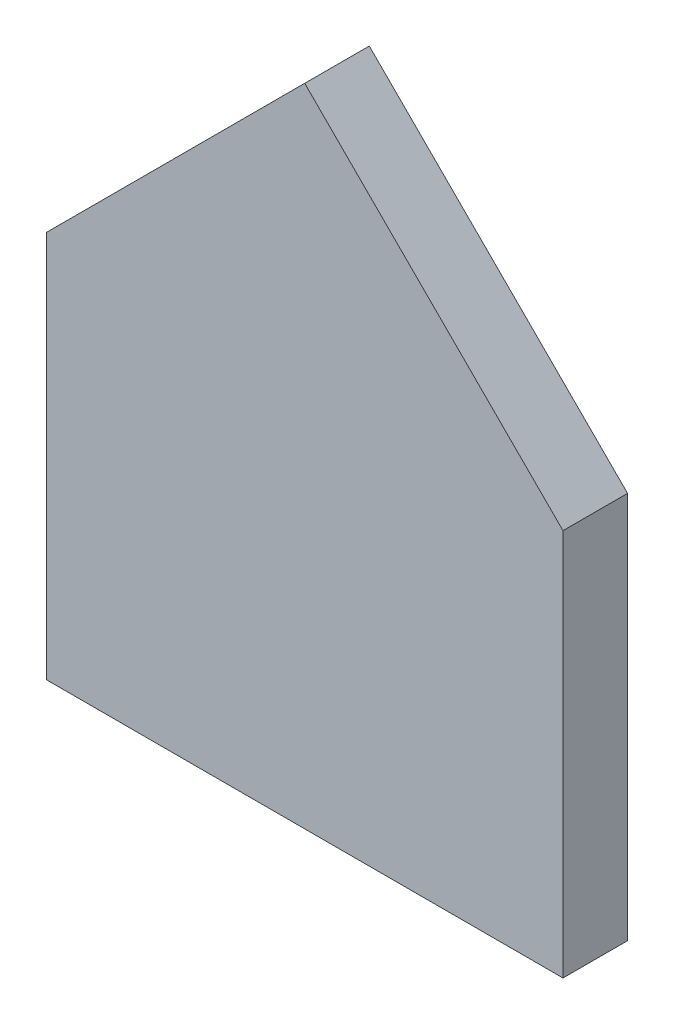
ISO-10303-21;
HEADER;
FILE_DESCRIPTION(('STEP AP214'),'2;1');
FILE_NAME('part.step','',(''),(''),'','','');
FILE_SCHEMA(('AUTOMOTIVE_DESIGN { 1 0 10303 214 1 1 1 1 }'));
ENDSEC;
DATA;
#1=APPLICATION_CONTEXT('core data for automotive mechanical design processes');
#2=APPLICATION_PROTOCOL_DEFINITION('international standard','automotive_design',2000,#1);
#3=PRODUCT_CONTEXT('',#1,'mechanical');
#4=PRODUCT('Part','Part','',(#3));
#5=PRODUCT_RELATED_PRODUCT_CATEGORY('part','',(#4));
#6=PRODUCT_DEFINITION_FORMATION('','',#4);
#7=PRODUCT_DEFINITION_CONTEXT('part definition',#1,'design');
#8=PRODUCT_DEFINITION('design','',#6,#7);
#9=PRODUCT_DEFINITION_SHAPE('','',#8);
#10=(LENGTH_UNIT() NAMED_UNIT(*) SI_UNIT(.MILLI.,.METRE.));
#11=(NAMED_UNIT(*) PLANE_ANGLE_UNIT() SI_UNIT($,.RADIAN.));
#12=(NAMED_UNIT(*) SI_UNIT($,.STERADIAN.) SOLID_ANGLE_UNIT());
#13=UNCERTAINTY_MEASURE_WITH_UNIT(LENGTH_MEASURE(1.E-05),#10,'distance_accuracy_value','');
#14=(GEOMETRIC_REPRESENTATION_CONTEXT(3) GLOBAL_UNCERTAINTY_ASSIGNED_CONTEXT((#13)) GLOBAL_UNIT_ASSIGNED_CONTEXT((#10,
#11,#12)) REPRESENTATION_CONTEXT('',''));
#15=CARTESIAN_POINT('',(0.,0.,0.));
#16=DIRECTION('',(0.,0.,1.));
#17=DIRECTION('',(1.,0.,0.));
#18=AXIS2_PLACEMENT_3D('',#15,#16,#17);
#19=CARTESIAN_POINT('',(0.,40.4007299218423,0.));
#20=DIRECTION('',(0.,0.,1.));
#21=DIRECTION('',(1.,0.,0.));
#22=AXIS2_PLACEMENT_3D('',#19,#20,#21);
#23=PLANE('',#22);
#24=DIRECTION('',(0.,1.,0.));
#25=VECTOR('',#24,1.);
#26=CARTESIAN_POINT('',(-40.,60.,0.));
#27=LINE('',#26,#25);
#28=CARTESIAN_POINT('',(-40.,60.,0.));
#29=VERTEX_POINT('',#28);
#30=CARTESIAN_POINT('',(-40.,0.,0.));
#31=VERTEX_POINT('',#30);
#32=EDGE_CURVE('E91',#29,#31,#27,.F.);
#33=ORIENTED_EDGE('',*,*,#32,.F.);
#34=DIRECTION('',(-0.707106781186547,-0.707106781186548,0.));
#35=VECTOR('',#34,1.);
#36=CARTESIAN_POINT('',(0.,100.,0.));
#37=LINE('',#36,#35);
#38=CARTESIAN_POINT('',(0.,100.,0.));
#39=VERTEX_POINT('',#38);
#40=EDGE_CURVE('E86',#39,#29,#37,.T.);
#41=ORIENTED_EDGE('',*,*,#40,.F.);
#42=DIRECTION('',(-0.707106781186547,0.707106781186548,0.));
#43=VECTOR('',#42,1.);
#44=CARTESIAN_POINT('',(40.,60.,0.));
#45=LINE('',#44,#43);
#46=CARTESIAN_POINT('',(40.,60.,0.));
#47=VERTEX_POINT('',#46);
#48=EDGE_CURVE('E62',#47,#39,#45,.T.);
#49=ORIENTED_EDGE('',*,*,#48,.F.);
#50=DIRECTION('',(0.,1.,0.));
#51=VECTOR('',#50,1.);
#52=CARTESIAN_POINT('',(40.,0.,0.));
#53=LINE('',#52,#51);
#54=CARTESIAN_POINT('',(40.,0.,0.));
#55=VERTEX_POINT('',#54);
#56=EDGE_CURVE('E64',#55,#47,#53,.T.);
#57=ORIENTED_EDGE('',*,*,#56,.F.);
#58=DIRECTION('',(1.,0.,0.));
#59=VECTOR('',#58,1.);
#60=CARTESIAN_POINT('',(-40.,0.,0.));
#61=LINE('',#60,#59);
#62=EDGE_CURVE('E20',#31,#55,#61,.T.);
#63=ORIENTED_EDGE('',*,*,#62,.F.);
#64=EDGE_LOOP('',(#33,#41,#49,#57,#63));
#65=FACE_BOUND('',#64,.T.);
#66=ADVANCED_FACE('F17',(#65),#23,.F.);
#67=CARTESIAN_POINT('',(-40.,0.,0.));
#68=DIRECTION('',(0.,-1.,0.));
#69=DIRECTION('',(1.,0.,0.));
#70=AXIS2_PLACEMENT_3D('',#67,#68,#69);
#71=PLANE('',#70);
#72=DIRECTION('',(1.,0.,0.));
#73=VECTOR('',#72,1.);
#74=CARTESIAN_POINT('',(0.,0.,10.));
#75=LINE('',#74,#73);
#76=CARTESIAN_POINT('',(-40.,0.,10.));
#77=VERTEX_POINT('',#76);
#78=CARTESIAN_POINT('',(40.,0.,10.));
#79=VERTEX_POINT('',#78);
#80=EDGE_CURVE('E95',#77,#79,#75,.T.);
#81=ORIENTED_EDGE('',*,*,#80,.F.);
#82=DIRECTION('',(0.,0.,1.));
#83=VECTOR('',#82,1.);
#84=CARTESIAN_POINT('',(-40.,0.,0.));
#85=LINE('',#84,#83);
#86=EDGE_CURVE('E75',#31,#77,#85,.T.);
#87=ORIENTED_EDGE('',*,*,#86,.F.);
#88=ORIENTED_EDGE('',*,*,#62,.T.);
#89=DIRECTION('',(0.,0.,1.));
#90=VECTOR('',#89,1.);
#91=CARTESIAN_POINT('',(40.,0.,0.));
#92=LINE('',#91,#90);
#93=EDGE_CURVE('E70',#79,#55,#92,.F.);
#94=ORIENTED_EDGE('',*,*,#93,.F.);
#95=EDGE_LOOP('',(#81,#87,#88,#94));
#96=FACE_BOUND('',#95,.T.);
#97=ADVANCED_FACE('F72',(#96),#71,.T.);
#98=CARTESIAN_POINT('',(40.,0.,0.));
#99=DIRECTION('',(1.,0.,0.));
#100=DIRECTION('',(0.,1.,0.));
#101=AXIS2_PLACEMENT_3D('',#98,#99,#100);
#102=PLANE('',#101);
#103=DIRECTION('',(0.,1.,0.));
#104=VECTOR('',#103,1.);
#105=CARTESIAN_POINT('',(40.,40.4007299218423,10.));
#106=LINE('',#105,#104);
#107=CARTESIAN_POINT('',(40.,60.,10.));
#108=VERTEX_POINT('',#107);
#109=EDGE_CURVE('E79',#79,#108,#106,.T.);
#110=ORIENTED_EDGE('',*,*,#109,.F.);
#111=ORIENTED_EDGE('',*,*,#93,.T.);
#112=ORIENTED_EDGE('',*,*,#56,.T.);
#113=DIRECTION('',(0.,0.,1.));
#114=VECTOR('',#113,1.);
#115=CARTESIAN_POINT('',(40.,60.,0.));
#116=LINE('',#115,#114);
#117=EDGE_CURVE('E82',#108,#47,#116,.F.);
#118=ORIENTED_EDGE('',*,*,#117,.F.);
#119=EDGE_LOOP('',(#110,#111,#112,#118));
#120=FACE_BOUND('',#119,.T.);
#121=ADVANCED_FACE('F77',(#120),#102,.T.);
#122=CARTESIAN_POINT('',(40.,60.,0.));
#123=DIRECTION('',(0.707106781186548,0.707106781186547,0.));
#124=DIRECTION('',(-0.707106781186547,0.707106781186548,0.));
#125=AXIS2_PLACEMENT_3D('',#122,#123,#124);
#126=PLANE('',#125);
#127=DIRECTION('',(-0.707106781186547,0.707106781186548,0.));
#128=VECTOR('',#127,1.);
#129=CARTESIAN_POINT('',(40.,60.,10.));
#130=LINE('',#129,#128);
#131=CARTESIAN_POINT('',(0.,100.,10.));
#132=VERTEX_POINT('',#131);
#133=EDGE_CURVE('E98',#108,#132,#130,.T.);
#134=ORIENTED_EDGE('',*,*,#133,.F.);
#135=ORIENTED_EDGE('',*,*,#117,.T.);
#136=ORIENTED_EDGE('',*,*,#48,.T.);
#137=DIRECTION('',(0.,0.,1.));
#138=VECTOR('',#137,1.);
#139=CARTESIAN_POINT('',(0.,100.,0.));
#140=LINE('',#139,#138);
#141=EDGE_CURVE('E88',#132,#39,#140,.F.);
#142=ORIENTED_EDGE('',*,*,#141,.F.);
#143=EDGE_LOOP('',(#134,#135,#136,#142));
#144=FACE_BOUND('',#143,.T.);
#145=ADVANCED_FACE('F107',(#144),#126,.T.);
#146=CARTESIAN_POINT('',(0.,100.,0.));
#147=DIRECTION('',(-0.707106781186548,0.707106781186547,0.));
#148=DIRECTION('',(-0.707106781186547,-0.707106781186548,0.));
#149=AXIS2_PLACEMENT_3D('',#146,#147,#148);
#150=PLANE('',#149);
#151=DIRECTION('',(-0.707106781186547,-0.707106781186548,0.));
#152=VECTOR('',#151,1.);
#153=CARTESIAN_POINT('',(0.,100.,10.));
#154=LINE('',#153,#152);
#155=CARTESIAN_POINT('',(-40.,60.,10.));
#156=VERTEX_POINT('',#155);
#157=EDGE_CURVE('E26',#132,#156,#154,.T.);
#158=ORIENTED_EDGE('',*,*,#157,.F.);
#159=ORIENTED_EDGE('',*,*,#141,.T.);
#160=ORIENTED_EDGE('',*,*,#40,.T.);
#161=DIRECTION('',(0.,0.,1.));
#162=VECTOR('',#161,1.);
#163=CARTESIAN_POINT('',(-40.,60.,0.));
#164=LINE('',#163,#162);
#165=EDGE_CURVE('E35',#156,#29,#164,.F.);
#166=ORIENTED_EDGE('',*,*,#165,.F.);
#167=EDGE_LOOP('',(#158,#159,#160,#166));
#168=FACE_BOUND('',#167,.T.);
#169=ADVANCED_FACE('F105',(#168),#150,.T.);
#170=CARTESIAN_POINT('',(-40.,60.,0.));
#171=DIRECTION('',(-1.,0.,0.));
#172=DIRECTION('',(0.,0.,1.));
#173=AXIS2_PLACEMENT_3D('',#170,#171,#172);
#174=PLANE('',#173);
#175=DIRECTION('',(0.,1.,0.));
#176=VECTOR('',#175,1.);
#177=CARTESIAN_POINT('',(-40.,40.4007299218423,10.));
#178=LINE('',#177,#176);
#179=EDGE_CURVE('E11',#156,#77,#178,.F.);
#180=ORIENTED_EDGE('',*,*,#179,.F.);
#181=ORIENTED_EDGE('',*,*,#165,.T.);
#182=ORIENTED_EDGE('',*,*,#32,.T.);
#183=ORIENTED_EDGE('',*,*,#86,.T.);
#184=EDGE_LOOP('',(#180,#181,#182,#183));
#185=FACE_BOUND('',#184,.T.);
#186=ADVANCED_FACE('F109',(#185),#174,.T.);
#187=CARTESIAN_POINT('',(0.,40.4007299218423,10.));
#188=DIRECTION('',(0.,0.,1.));
#189=DIRECTION('',(1.,0.,0.));
#190=AXIS2_PLACEMENT_3D('',#187,#188,#189);
#191=PLANE('',#190);
#192=ORIENTED_EDGE('',*,*,#157,.T.);
#193=ORIENTED_EDGE('',*,*,#179,.T.);
#194=ORIENTED_EDGE('',*,*,#80,.T.);
#195=ORIENTED_EDGE('',*,*,#109,.T.);
#196=ORIENTED_EDGE('',*,*,#133,.T.);
#197=EDGE_LOOP('',(#192,#193,#194,#195,#196));
#198=FACE_BOUND('',#197,.T.);
#199=ADVANCED_FACE('F103',(#198),#191,.T.);
#200=CLOSED_SHELL('',(#66,#97,#121,#145,#169,#186,#199));
#201=MANIFOLD_SOLID_BREP('B1',#200);
#202=ADVANCED_BREP_SHAPE_REPRESENTATION('',(#18,#201),#14);
#203=SHAPE_DEFINITION_REPRESENTATION(#9,#202);
ENDSEC;
END-ISO-10303-21;
